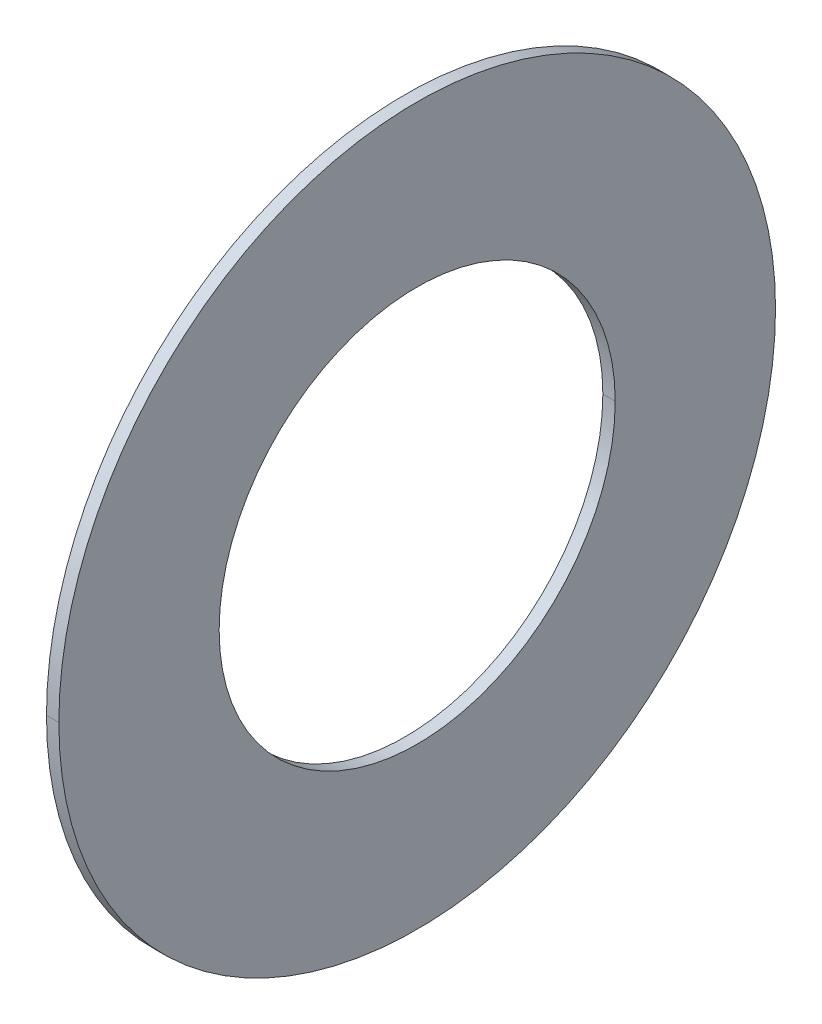
ISO-10303-21;
HEADER;
FILE_DESCRIPTION(('STEP AP214'),'2;1');
FILE_NAME('part.step','',(''),(''),'','','');
FILE_SCHEMA(('AUTOMOTIVE_DESIGN { 1 0 10303 214 1 1 1 1 }'));
ENDSEC;
DATA;
#1=APPLICATION_CONTEXT('core data for automotive mechanical design processes');
#2=APPLICATION_PROTOCOL_DEFINITION('international standard','automotive_design',2000,#1);
#3=PRODUCT_CONTEXT('',#1,'mechanical');
#4=PRODUCT('Part','Part','',(#3));
#5=PRODUCT_RELATED_PRODUCT_CATEGORY('part','',(#4));
#6=PRODUCT_DEFINITION_FORMATION('','',#4);
#7=PRODUCT_DEFINITION_CONTEXT('part definition',#1,'design');
#8=PRODUCT_DEFINITION('design','',#6,#7);
#9=PRODUCT_DEFINITION_SHAPE('','',#8);
#10=(LENGTH_UNIT() NAMED_UNIT(*) SI_UNIT(.MILLI.,.METRE.));
#11=(NAMED_UNIT(*) PLANE_ANGLE_UNIT() SI_UNIT($,.RADIAN.));
#12=(NAMED_UNIT(*) SI_UNIT($,.STERADIAN.) SOLID_ANGLE_UNIT());
#13=UNCERTAINTY_MEASURE_WITH_UNIT(LENGTH_MEASURE(1.E-05),#10,'distance_accuracy_value','');
#14=(GEOMETRIC_REPRESENTATION_CONTEXT(3) GLOBAL_UNCERTAINTY_ASSIGNED_CONTEXT((#13)) GLOBAL_UNIT_ASSIGNED_CONTEXT((#10,
#11,#12)) REPRESENTATION_CONTEXT('',''));
#15=CARTESIAN_POINT('',(0.,0.,0.));
#16=DIRECTION('',(0.,0.,1.));
#17=DIRECTION('',(1.,0.,0.));
#18=AXIS2_PLACEMENT_3D('',#15,#16,#17);
#19=CARTESIAN_POINT('',(6.5625,9.5,0.));
#20=DIRECTION('',(-1.,0.,0.));
#21=DIRECTION('',(0.,0.,1.));
#22=AXIS2_PLACEMENT_3D('',#19,#20,#21);
#23=PLANE('',#22);
#24=CARTESIAN_POINT('',(6.5625,0.,0.));
#25=DIRECTION('',(1.,0.,0.));
#26=DIRECTION('',(0.,0.,-1.));
#27=AXIS2_PLACEMENT_3D('',#24,#25,#26);
#28=CIRCLE('',#27,5.25);
#29=CARTESIAN_POINT('',(6.5625,0.,-5.25));
#30=VERTEX_POINT('',#29);
#31=CARTESIAN_POINT('',(6.5625,0.,5.25));
#32=VERTEX_POINT('',#31);
#33=EDGE_CURVE('E11',#30,#32,#28,.T.);
#34=ORIENTED_EDGE('',*,*,#33,.T.);
#35=CARTESIAN_POINT('',(6.5625,0.,0.));
#36=DIRECTION('',(1.,0.,0.));
#37=DIRECTION('',(0.,0.,-1.));
#38=AXIS2_PLACEMENT_3D('',#35,#36,#37);
#39=CIRCLE('',#38,5.25);
#40=EDGE_CURVE('E24',#32,#30,#39,.T.);
#41=ORIENTED_EDGE('',*,*,#40,.T.);
#42=EDGE_LOOP('',(#34,#41));
#43=FACE_BOUND('',#42,.T.);
#44=CARTESIAN_POINT('',(6.5625,0.,0.));
#45=DIRECTION('',(1.,0.,0.));
#46=DIRECTION('',(0.,0.,-1.));
#47=AXIS2_PLACEMENT_3D('',#44,#45,#46);
#48=CIRCLE('',#47,9.5);
#49=CARTESIAN_POINT('',(6.5625,0.,-9.5));
#50=VERTEX_POINT('',#49);
#51=CARTESIAN_POINT('',(6.5625,0.,9.5));
#52=VERTEX_POINT('',#51);
#53=EDGE_CURVE('E95',#50,#52,#48,.T.);
#54=ORIENTED_EDGE('',*,*,#53,.F.);
#55=CARTESIAN_POINT('',(6.5625,0.,0.));
#56=DIRECTION('',(1.,0.,0.));
#57=DIRECTION('',(0.,0.,-1.));
#58=AXIS2_PLACEMENT_3D('',#55,#56,#57);
#59=CIRCLE('',#58,9.5);
#60=EDGE_CURVE('E90',#52,#50,#59,.T.);
#61=ORIENTED_EDGE('',*,*,#60,.F.);
#62=EDGE_LOOP('',(#54,#61));
#63=FACE_BOUND('',#62,.T.);
#64=ADVANCED_FACE('F16',(#43,#63),#23,.T.);
#65=CARTESIAN_POINT('',(6.89045,0.,0.));
#66=DIRECTION('',(-1.,0.,0.));
#67=DIRECTION('',(0.,1.,0.));
#68=AXIS2_PLACEMENT_3D('',#65,#66,#67);
#69=CYLINDRICAL_SURFACE('',#68,9.5);
#70=ORIENTED_EDGE('',*,*,#60,.T.);
#71=DIRECTION('',(-1.,0.,0.));
#72=VECTOR('',#71,1.);
#73=CARTESIAN_POINT('',(6.89045,0.,-9.5));
#74=LINE('',#73,#72);
#75=CARTESIAN_POINT('',(6.89045,0.,-9.5));
#76=VERTEX_POINT('',#75);
#77=EDGE_CURVE('E85',#76,#50,#74,.T.);
#78=ORIENTED_EDGE('',*,*,#77,.F.);
#79=CARTESIAN_POINT('',(6.89045,0.,0.));
#80=DIRECTION('',(1.,0.,0.));
#81=DIRECTION('',(0.,0.,-1.));
#82=AXIS2_PLACEMENT_3D('',#79,#80,#81);
#83=CIRCLE('',#82,9.5);
#84=CARTESIAN_POINT('',(6.89045,0.,9.5));
#85=VERTEX_POINT('',#84);
#86=EDGE_CURVE('E80',#85,#76,#83,.T.);
#87=ORIENTED_EDGE('',*,*,#86,.F.);
#88=DIRECTION('',(-1.,0.,0.));
#89=VECTOR('',#88,1.);
#90=CARTESIAN_POINT('',(6.89045,0.,9.5));
#91=LINE('',#90,#89);
#92=EDGE_CURVE('E69',#85,#52,#91,.T.);
#93=ORIENTED_EDGE('',*,*,#92,.T.);
#94=EDGE_LOOP('',(#70,#78,#87,#93));
#95=FACE_BOUND('',#94,.T.);
#96=ADVANCED_FACE('F110',(#95),#69,.T.);
#97=CARTESIAN_POINT('',(6.89045,0.,0.));
#98=DIRECTION('',(-1.,0.,0.));
#99=DIRECTION('',(0.,-1.,0.));
#100=AXIS2_PLACEMENT_3D('',#97,#98,#99);
#101=CYLINDRICAL_SURFACE('',#100,9.5);
#102=CARTESIAN_POINT('',(6.89045,0.,0.));
#103=DIRECTION('',(1.,0.,0.));
#104=DIRECTION('',(0.,0.,-1.));
#105=AXIS2_PLACEMENT_3D('',#102,#103,#104);
#106=CIRCLE('',#105,9.5);
#107=EDGE_CURVE('E66',#76,#85,#106,.T.);
#108=ORIENTED_EDGE('',*,*,#107,.F.);
#109=ORIENTED_EDGE('',*,*,#77,.T.);
#110=ORIENTED_EDGE('',*,*,#53,.T.);
#111=ORIENTED_EDGE('',*,*,#92,.F.);
#112=EDGE_LOOP('',(#108,#109,#110,#111));
#113=FACE_BOUND('',#112,.T.);
#114=ADVANCED_FACE('F107',(#113),#101,.T.);
#115=CARTESIAN_POINT('',(6.89045,5.25,0.));
#116=DIRECTION('',(1.,0.,0.));
#117=DIRECTION('',(0.,0.,-1.));
#118=AXIS2_PLACEMENT_3D('',#115,#116,#117);
#119=PLANE('',#118);
#120=ORIENTED_EDGE('',*,*,#107,.T.);
#121=ORIENTED_EDGE('',*,*,#86,.T.);
#122=EDGE_LOOP('',(#120,#121));
#123=FACE_BOUND('',#122,.T.);
#124=CARTESIAN_POINT('',(6.89045,0.,0.));
#125=DIRECTION('',(1.,0.,0.));
#126=DIRECTION('',(0.,0.,-1.));
#127=AXIS2_PLACEMENT_3D('',#124,#125,#126);
#128=CIRCLE('',#127,5.25);
#129=CARTESIAN_POINT('',(6.89045,0.,-5.25));
#130=VERTEX_POINT('',#129);
#131=CARTESIAN_POINT('',(6.89045,0.,5.25));
#132=VERTEX_POINT('',#131);
#133=EDGE_CURVE('E55',#130,#132,#128,.T.);
#134=ORIENTED_EDGE('',*,*,#133,.F.);
#135=CARTESIAN_POINT('',(6.89045,0.,0.));
#136=DIRECTION('',(1.,0.,0.));
#137=DIRECTION('',(0.,0.,-1.));
#138=AXIS2_PLACEMENT_3D('',#135,#136,#137);
#139=CIRCLE('',#138,5.25);
#140=EDGE_CURVE('E51',#132,#130,#139,.T.);
#141=ORIENTED_EDGE('',*,*,#140,.F.);
#142=EDGE_LOOP('',(#134,#141));
#143=FACE_BOUND('',#142,.T.);
#144=ADVANCED_FACE('F53',(#123,#143),#119,.T.);
#145=CARTESIAN_POINT('',(6.89045,0.,0.));
#146=DIRECTION('',(-1.,0.,0.));
#147=DIRECTION('',(0.,1.,0.));
#148=AXIS2_PLACEMENT_3D('',#145,#146,#147);
#149=CYLINDRICAL_SURFACE('',#148,5.25);
#150=ORIENTED_EDGE('',*,*,#40,.F.);
#151=DIRECTION('',(-1.,0.,0.));
#152=VECTOR('',#151,1.);
#153=CARTESIAN_POINT('',(6.89045,0.,5.25));
#154=LINE('',#153,#152);
#155=EDGE_CURVE('E58',#132,#32,#154,.T.);
#156=ORIENTED_EDGE('',*,*,#155,.F.);
#157=ORIENTED_EDGE('',*,*,#140,.T.);
#158=DIRECTION('',(-1.,0.,0.));
#159=VECTOR('',#158,1.);
#160=CARTESIAN_POINT('',(6.89045,0.,-5.25));
#161=LINE('',#160,#159);
#162=EDGE_CURVE('E63',#130,#30,#161,.T.);
#163=ORIENTED_EDGE('',*,*,#162,.T.);
#164=EDGE_LOOP('',(#150,#156,#157,#163));
#165=FACE_BOUND('',#164,.T.);
#166=ADVANCED_FACE('F61',(#165),#149,.F.);
#167=CARTESIAN_POINT('',(6.89045,0.,0.));
#168=DIRECTION('',(-1.,0.,0.));
#169=DIRECTION('',(0.,-1.,0.));
#170=AXIS2_PLACEMENT_3D('',#167,#168,#169);
#171=CYLINDRICAL_SURFACE('',#170,5.25);
#172=ORIENTED_EDGE('',*,*,#133,.T.);
#173=ORIENTED_EDGE('',*,*,#155,.T.);
#174=ORIENTED_EDGE('',*,*,#33,.F.);
#175=ORIENTED_EDGE('',*,*,#162,.F.);
#176=EDGE_LOOP('',(#172,#173,#174,#175));
#177=FACE_BOUND('',#176,.T.);
#178=ADVANCED_FACE('F65',(#177),#171,.F.);
#179=CLOSED_SHELL('',(#64,#96,#114,#144,#166,#178));
#180=MANIFOLD_SOLID_BREP('B1',#179);
#181=ADVANCED_BREP_SHAPE_REPRESENTATION('',(#18,#180),#14);
#182=SHAPE_DEFINITION_REPRESENTATION(#9,#181);
ENDSEC;
END-ISO-10303-21;
